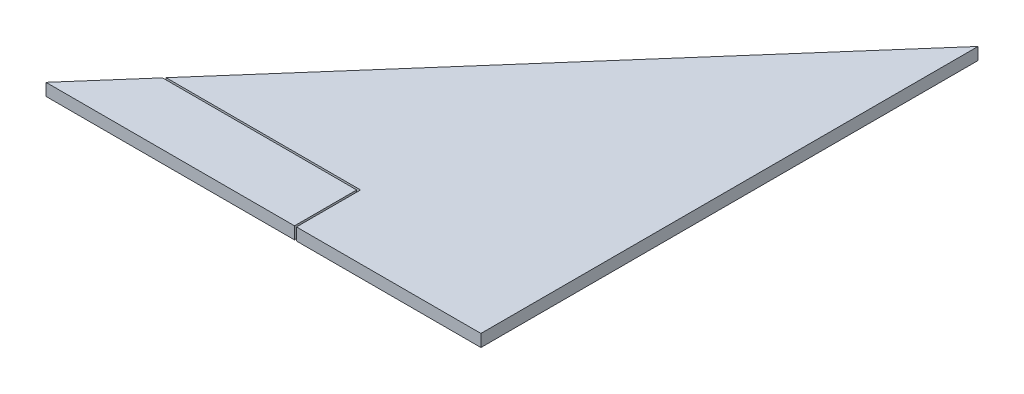
ISO-10303-21;
HEADER;
FILE_DESCRIPTION(('STEP AP214'),'2;1');
FILE_NAME('part.step','',(''),(''),'','','');
FILE_SCHEMA(('AUTOMOTIVE_DESIGN { 1 0 10303 214 1 1 1 1 }'));
ENDSEC;
DATA;
#1=APPLICATION_CONTEXT('core data for automotive mechanical design processes');
#2=APPLICATION_PROTOCOL_DEFINITION('international standard','automotive_design',2000,#1);
#3=PRODUCT_CONTEXT('',#1,'mechanical');
#4=PRODUCT('Part','Part','',(#3));
#5=PRODUCT_RELATED_PRODUCT_CATEGORY('part','',(#4));
#6=PRODUCT_DEFINITION_FORMATION('','',#4);
#7=PRODUCT_DEFINITION_CONTEXT('part definition',#1,'design');
#8=PRODUCT_DEFINITION('design','',#6,#7);
#9=PRODUCT_DEFINITION_SHAPE('','',#8);
#10=(LENGTH_UNIT() NAMED_UNIT(*) SI_UNIT(.MILLI.,.METRE.));
#11=(NAMED_UNIT(*) PLANE_ANGLE_UNIT() SI_UNIT($,.RADIAN.));
#12=(NAMED_UNIT(*) SI_UNIT($,.STERADIAN.) SOLID_ANGLE_UNIT());
#13=UNCERTAINTY_MEASURE_WITH_UNIT(LENGTH_MEASURE(1.E-05),#10,'distance_accuracy_value','');
#14=(GEOMETRIC_REPRESENTATION_CONTEXT(3) GLOBAL_UNCERTAINTY_ASSIGNED_CONTEXT((#13)) GLOBAL_UNIT_ASSIGNED_CONTEXT((#10,
#11,#12)) REPRESENTATION_CONTEXT('',''));
#15=CARTESIAN_POINT('',(0.,0.,0.));
#16=DIRECTION('',(0.,0.,1.));
#17=DIRECTION('',(1.,0.,0.));
#18=AXIS2_PLACEMENT_3D('',#15,#16,#17);
#19=CARTESIAN_POINT('',(-100.700884955752,5.,-88.1132743362832));
#20=DIRECTION('',(0.752576694706878,0.,0.658504607868518));
#21=DIRECTION('',(0.658504607868518,0.,-0.752576694706878));
#22=AXIS2_PLACEMENT_3D('',#19,#20,#21);
#23=PLANE('',#22);
#24=DIRECTION('',(0.,-1.,0.));
#25=VECTOR('',#24,1.);
#26=CARTESIAN_POINT('',(-154.88046875,5.,-26.19375));
#27=LINE('',#26,#25);
#28=CARTESIAN_POINT('',(-154.88046875,5.,-26.19375));
#29=VERTEX_POINT('',#28);
#30=CARTESIAN_POINT('',(-154.88046875,0.,-26.19375));
#31=VERTEX_POINT('',#30);
#32=EDGE_CURVE('E12',#29,#31,#27,.T.);
#33=ORIENTED_EDGE('',*,*,#32,.F.);
#34=DIRECTION('',(-0.658504607868518,0.,0.752576694706878));
#35=VECTOR('',#34,1.);
#36=CARTESIAN_POINT('',(-100.700884955752,5.,-88.1132743362832));
#37=LINE('',#36,#35);
#38=CARTESIAN_POINT('',(0.,5.,-203.2));
#39=VERTEX_POINT('',#38);
#40=EDGE_CURVE('E108',#39,#29,#37,.T.);
#41=ORIENTED_EDGE('',*,*,#40,.F.);
#42=DIRECTION('',(0.,-1.,0.));
#43=VECTOR('',#42,1.);
#44=CARTESIAN_POINT('',(0.,5.,-203.2));
#45=LINE('',#44,#43);
#46=CARTESIAN_POINT('',(0.,0.,-203.2));
#47=VERTEX_POINT('',#46);
#48=EDGE_CURVE('E152',#39,#47,#45,.T.);
#49=ORIENTED_EDGE('',*,*,#48,.T.);
#50=DIRECTION('',(-0.658504607868518,0.,0.752576694706878));
#51=VECTOR('',#50,1.);
#52=CARTESIAN_POINT('',(-100.700884955752,0.,-88.1132743362832));
#53=LINE('',#52,#51);
#54=EDGE_CURVE('E54',#47,#31,#53,.T.);
#55=ORIENTED_EDGE('',*,*,#54,.T.);
#56=EDGE_LOOP('',(#33,#41,#49,#55));
#57=FACE_BOUND('',#56,.T.);
#58=ADVANCED_FACE('F51',(#57),#23,.F.);
#59=CARTESIAN_POINT('',(0.,5.,0.));
#60=DIRECTION('',(0.,0.,-1.));
#61=DIRECTION('',(-1.,0.,0.));
#62=AXIS2_PLACEMENT_3D('',#59,#60,#61);
#63=PLANE('',#62);
#64=DIRECTION('',(0.,-1.,0.));
#65=VECTOR('',#64,1.);
#66=CARTESIAN_POINT('',(-75.40625,6.,0.));
#67=LINE('',#66,#65);
#68=CARTESIAN_POINT('',(-75.40625,5.,0.));
#69=VERTEX_POINT('',#68);
#70=CARTESIAN_POINT('',(-75.40625,0.,0.));
#71=VERTEX_POINT('',#70);
#72=EDGE_CURVE('E91',#69,#71,#67,.T.);
#73=ORIENTED_EDGE('',*,*,#72,.T.);
#74=DIRECTION('',(1.,0.,0.));
#75=VECTOR('',#74,1.);
#76=CARTESIAN_POINT('',(0.,0.,0.));
#77=LINE('',#76,#75);
#78=CARTESIAN_POINT('',(0.,0.,0.));
#79=VERTEX_POINT('',#78);
#80=EDGE_CURVE('E112',#71,#79,#77,.T.);
#81=ORIENTED_EDGE('',*,*,#80,.T.);
#82=DIRECTION('',(0.,-1.,0.));
#83=VECTOR('',#82,1.);
#84=CARTESIAN_POINT('',(0.,5.,0.));
#85=LINE('',#84,#83);
#86=CARTESIAN_POINT('',(0.,5.,0.));
#87=VERTEX_POINT('',#86);
#88=EDGE_CURVE('E102',#87,#79,#85,.T.);
#89=ORIENTED_EDGE('',*,*,#88,.F.);
#90=DIRECTION('',(1.,0.,0.));
#91=VECTOR('',#90,1.);
#92=CARTESIAN_POINT('',(0.,5.,0.));
#93=LINE('',#92,#91);
#94=EDGE_CURVE('E96',#69,#87,#93,.T.);
#95=ORIENTED_EDGE('',*,*,#94,.F.);
#96=EDGE_LOOP('',(#73,#81,#89,#95));
#97=FACE_BOUND('',#96,.T.);
#98=ADVANCED_FACE('F133',(#97),#63,.F.);
#99=CARTESIAN_POINT('',(0.,5.,0.));
#100=DIRECTION('',(0.,1.,0.));
#101=DIRECTION('',(0.,0.,1.));
#102=AXIS2_PLACEMENT_3D('',#99,#100,#101);
#103=PLANE('',#102);
#104=ORIENTED_EDGE('',*,*,#40,.T.);
#105=DIRECTION('',(1.,0.,0.));
#106=VECTOR('',#105,1.);
#107=CARTESIAN_POINT('',(0.,5.,-26.19375));
#108=LINE('',#107,#106);
#109=CARTESIAN_POINT('',(-75.40625,5.,-26.19375));
#110=VERTEX_POINT('',#109);
#111=EDGE_CURVE('E69',#29,#110,#108,.T.);
#112=ORIENTED_EDGE('',*,*,#111,.T.);
#113=DIRECTION('',(0.,0.,1.));
#114=VECTOR('',#113,1.);
#115=CARTESIAN_POINT('',(-75.40625,5.,0.));
#116=LINE('',#115,#114);
#117=EDGE_CURVE('E86',#110,#69,#116,.T.);
#118=ORIENTED_EDGE('',*,*,#117,.T.);
#119=ORIENTED_EDGE('',*,*,#94,.T.);
#120=DIRECTION('',(0.,0.,-1.));
#121=VECTOR('',#120,1.);
#122=CARTESIAN_POINT('',(0.,5.,0.));
#123=LINE('',#122,#121);
#124=EDGE_CURVE('E124',#87,#39,#123,.T.);
#125=ORIENTED_EDGE('',*,*,#124,.T.);
#126=EDGE_LOOP('',(#104,#112,#118,#119,#125));
#127=FACE_BOUND('',#126,.T.);
#128=ADVANCED_FACE('F105',(#127),#103,.T.);
#129=CARTESIAN_POINT('',(0.,0.,0.));
#130=DIRECTION('',(0.,1.,0.));
#131=DIRECTION('',(0.,0.,1.));
#132=AXIS2_PLACEMENT_3D('',#129,#130,#131);
#133=PLANE('',#132);
#134=DIRECTION('',(-1.,0.,0.));
#135=VECTOR('',#134,1.);
#136=CARTESIAN_POINT('',(-76.2,0.,-26.19375));
#137=LINE('',#136,#135);
#138=CARTESIAN_POINT('',(-75.40625,0.,-26.19375));
#139=VERTEX_POINT('',#138);
#140=EDGE_CURVE('E100',#139,#31,#137,.T.);
#141=ORIENTED_EDGE('',*,*,#140,.T.);
#142=ORIENTED_EDGE('',*,*,#54,.F.);
#143=DIRECTION('',(0.,0.,-1.));
#144=VECTOR('',#143,1.);
#145=CARTESIAN_POINT('',(0.,0.,0.));
#146=LINE('',#145,#144);
#147=EDGE_CURVE('E121',#79,#47,#146,.T.);
#148=ORIENTED_EDGE('',*,*,#147,.F.);
#149=ORIENTED_EDGE('',*,*,#80,.F.);
#150=DIRECTION('',(0.,0.,-1.));
#151=VECTOR('',#150,1.);
#152=CARTESIAN_POINT('',(-75.40625,0.,0.));
#153=LINE('',#152,#151);
#154=EDGE_CURVE('E118',#71,#139,#153,.T.);
#155=ORIENTED_EDGE('',*,*,#154,.T.);
#156=EDGE_LOOP('',(#141,#142,#148,#149,#155));
#157=FACE_BOUND('',#156,.T.);
#158=ADVANCED_FACE('F147',(#157),#133,.F.);
#159=CARTESIAN_POINT('',(0.,5.,0.));
#160=DIRECTION('',(-1.,0.,0.));
#161=DIRECTION('',(0.,0.,1.));
#162=AXIS2_PLACEMENT_3D('',#159,#160,#161);
#163=PLANE('',#162);
#164=ORIENTED_EDGE('',*,*,#147,.T.);
#165=ORIENTED_EDGE('',*,*,#48,.F.);
#166=ORIENTED_EDGE('',*,*,#124,.F.);
#167=ORIENTED_EDGE('',*,*,#88,.T.);
#168=EDGE_LOOP('',(#164,#165,#166,#167));
#169=FACE_BOUND('',#168,.T.);
#170=ADVANCED_FACE('F140',(#169),#163,.F.);
#171=CARTESIAN_POINT('',(-75.40625,6.,0.));
#172=DIRECTION('',(-1.,0.,0.));
#173=DIRECTION('',(0.,0.,1.));
#174=AXIS2_PLACEMENT_3D('',#171,#172,#173);
#175=PLANE('',#174);
#176=DIRECTION('',(0.,-1.,0.));
#177=VECTOR('',#176,1.);
#178=CARTESIAN_POINT('',(-75.40625,6.,-26.19375));
#179=LINE('',#178,#177);
#180=EDGE_CURVE('E61',#110,#139,#179,.T.);
#181=ORIENTED_EDGE('',*,*,#180,.T.);
#182=ORIENTED_EDGE('',*,*,#154,.F.);
#183=ORIENTED_EDGE('',*,*,#72,.F.);
#184=ORIENTED_EDGE('',*,*,#117,.F.);
#185=EDGE_LOOP('',(#181,#182,#183,#184));
#186=FACE_BOUND('',#185,.T.);
#187=ADVANCED_FACE('F87',(#186),#175,.T.);
#188=CARTESIAN_POINT('',(-76.2,6.,-26.19375));
#189=DIRECTION('',(0.,0.,1.));
#190=DIRECTION('',(1.,0.,0.));
#191=AXIS2_PLACEMENT_3D('',#188,#189,#190);
#192=PLANE('',#191);
#193=ORIENTED_EDGE('',*,*,#32,.T.);
#194=ORIENTED_EDGE('',*,*,#140,.F.);
#195=ORIENTED_EDGE('',*,*,#180,.F.);
#196=ORIENTED_EDGE('',*,*,#111,.F.);
#197=EDGE_LOOP('',(#193,#194,#195,#196));
#198=FACE_BOUND('',#197,.T.);
#199=ADVANCED_FACE('F98',(#198),#192,.T.);
#200=CLOSED_SHELL('',(#58,#98,#128,#158,#170,#187,#199));
#201=MANIFOLD_SOLID_BREP('B2',#200);
#202=CARTESIAN_POINT('',(0.,5.,0.));
#203=DIRECTION('',(0.,1.,0.));
#204=DIRECTION('',(0.,0.,1.));
#205=AXIS2_PLACEMENT_3D('',#202,#203,#204);
#206=PLANE('',#205);
#207=DIRECTION('',(1.,0.,0.));
#208=VECTOR('',#207,1.);
#209=CARTESIAN_POINT('',(0.,5.,-25.4));
#210=LINE('',#209,#208);
#211=CARTESIAN_POINT('',(-155.575,5.,-25.4));
#212=VERTEX_POINT('',#211);
#213=CARTESIAN_POINT('',(-76.2,5.,-25.4));
#214=VERTEX_POINT('',#213);
#215=EDGE_CURVE('E284',#212,#214,#210,.T.);
#216=ORIENTED_EDGE('',*,*,#215,.F.);
#217=DIRECTION('',(-0.658504607868518,0.,0.752576694706878));
#218=VECTOR('',#217,1.);
#219=CARTESIAN_POINT('',(-100.700884955752,5.,-88.1132743362832));
#220=LINE('',#219,#218);
#221=CARTESIAN_POINT('',(-177.8,5.,0.));
#222=VERTEX_POINT('',#221);
#223=EDGE_CURVE('E246',#212,#222,#220,.T.);
#224=ORIENTED_EDGE('',*,*,#223,.T.);
#225=DIRECTION('',(1.,0.,0.));
#226=VECTOR('',#225,1.);
#227=CARTESIAN_POINT('',(0.,5.,0.));
#228=LINE('',#227,#226);
#229=CARTESIAN_POINT('',(-76.2,5.,0.));
#230=VERTEX_POINT('',#229);
#231=EDGE_CURVE('E230',#222,#230,#228,.T.);
#232=ORIENTED_EDGE('',*,*,#231,.T.);
#233=DIRECTION('',(0.,0.,1.));
#234=VECTOR('',#233,1.);
#235=CARTESIAN_POINT('',(-76.2,5.,0.));
#236=LINE('',#235,#234);
#237=EDGE_CURVE('E279',#214,#230,#236,.T.);
#238=ORIENTED_EDGE('',*,*,#237,.F.);
#239=EDGE_LOOP('',(#216,#224,#232,#238));
#240=FACE_BOUND('',#239,.T.);
#241=ADVANCED_FACE('F222',(#240),#206,.T.);
#242=CARTESIAN_POINT('',(0.,0.,0.));
#243=DIRECTION('',(0.,1.,0.));
#244=DIRECTION('',(0.,0.,1.));
#245=AXIS2_PLACEMENT_3D('',#242,#243,#244);
#246=PLANE('',#245);
#247=DIRECTION('',(-0.658504607868518,0.,0.752576694706878));
#248=VECTOR('',#247,1.);
#249=CARTESIAN_POINT('',(-100.700884955752,0.,-88.1132743362832));
#250=LINE('',#249,#248);
#251=CARTESIAN_POINT('',(-155.575,0.,-25.4));
#252=VERTEX_POINT('',#251);
#253=CARTESIAN_POINT('',(-177.8,0.,0.));
#254=VERTEX_POINT('',#253);
#255=EDGE_CURVE('E277',#252,#254,#250,.T.);
#256=ORIENTED_EDGE('',*,*,#255,.F.);
#257=DIRECTION('',(-1.,0.,0.));
#258=VECTOR('',#257,1.);
#259=CARTESIAN_POINT('',(-76.2,0.,-25.4));
#260=LINE('',#259,#258);
#261=CARTESIAN_POINT('',(-76.2,0.,-25.4));
#262=VERTEX_POINT('',#261);
#263=EDGE_CURVE('E265',#262,#252,#260,.T.);
#264=ORIENTED_EDGE('',*,*,#263,.F.);
#265=DIRECTION('',(0.,0.,-1.));
#266=VECTOR('',#265,1.);
#267=CARTESIAN_POINT('',(-76.2,0.,0.));
#268=LINE('',#267,#266);
#269=CARTESIAN_POINT('',(-76.2,0.,0.));
#270=VERTEX_POINT('',#269);
#271=EDGE_CURVE('E273',#270,#262,#268,.T.);
#272=ORIENTED_EDGE('',*,*,#271,.F.);
#273=DIRECTION('',(1.,0.,0.));
#274=VECTOR('',#273,1.);
#275=CARTESIAN_POINT('',(0.,0.,0.));
#276=LINE('',#275,#274);
#277=EDGE_CURVE('E283',#254,#270,#276,.T.);
#278=ORIENTED_EDGE('',*,*,#277,.F.);
#279=EDGE_LOOP('',(#256,#264,#272,#278));
#280=FACE_BOUND('',#279,.T.);
#281=ADVANCED_FACE('F281',(#280),#246,.F.);
#282=CARTESIAN_POINT('',(0.,5.,0.));
#283=DIRECTION('',(0.,0.,-1.));
#284=DIRECTION('',(-1.,0.,0.));
#285=AXIS2_PLACEMENT_3D('',#282,#283,#284);
#286=PLANE('',#285);
#287=ORIENTED_EDGE('',*,*,#277,.T.);
#288=DIRECTION('',(0.,-1.,0.));
#289=VECTOR('',#288,1.);
#290=CARTESIAN_POINT('',(-76.2,6.,0.));
#291=LINE('',#290,#289);
#292=EDGE_CURVE('E237',#230,#270,#291,.T.);
#293=ORIENTED_EDGE('',*,*,#292,.F.);
#294=ORIENTED_EDGE('',*,*,#231,.F.);
#295=DIRECTION('',(0.,-1.,0.));
#296=VECTOR('',#295,1.);
#297=CARTESIAN_POINT('',(-177.8,5.,0.));
#298=LINE('',#297,#296);
#299=EDGE_CURVE('E49',#222,#254,#298,.T.);
#300=ORIENTED_EDGE('',*,*,#299,.T.);
#301=EDGE_LOOP('',(#287,#293,#294,#300));
#302=FACE_BOUND('',#301,.T.);
#303=ADVANCED_FACE('F296',(#302),#286,.F.);
#304=CARTESIAN_POINT('',(-100.700884955752,5.,-88.1132743362832));
#305=DIRECTION('',(0.752576694706878,0.,0.658504607868518));
#306=DIRECTION('',(0.658504607868518,0.,-0.752576694706878));
#307=AXIS2_PLACEMENT_3D('',#304,#305,#306);
#308=PLANE('',#307);
#309=ORIENTED_EDGE('',*,*,#223,.F.);
#310=DIRECTION('',(0.,-1.,0.));
#311=VECTOR('',#310,1.);
#312=CARTESIAN_POINT('',(-155.575,6.,-25.4));
#313=LINE('',#312,#311);
#314=EDGE_CURVE('E268',#212,#252,#313,.T.);
#315=ORIENTED_EDGE('',*,*,#314,.T.);
#316=ORIENTED_EDGE('',*,*,#255,.T.);
#317=ORIENTED_EDGE('',*,*,#299,.F.);
#318=EDGE_LOOP('',(#309,#315,#316,#317));
#319=FACE_BOUND('',#318,.T.);
#320=ADVANCED_FACE('F224',(#319),#308,.F.);
#321=CARTESIAN_POINT('',(-76.2,6.,-25.4));
#322=DIRECTION('',(0.,0.,1.));
#323=DIRECTION('',(1.,0.,0.));
#324=AXIS2_PLACEMENT_3D('',#321,#322,#323);
#325=PLANE('',#324);
#326=ORIENTED_EDGE('',*,*,#215,.T.);
#327=DIRECTION('',(0.,-1.,0.));
#328=VECTOR('',#327,1.);
#329=CARTESIAN_POINT('',(-76.2,6.,-25.4));
#330=LINE('',#329,#328);
#331=EDGE_CURVE('E270',#214,#262,#330,.T.);
#332=ORIENTED_EDGE('',*,*,#331,.T.);
#333=ORIENTED_EDGE('',*,*,#263,.T.);
#334=ORIENTED_EDGE('',*,*,#314,.F.);
#335=EDGE_LOOP('',(#326,#332,#333,#334));
#336=FACE_BOUND('',#335,.T.);
#337=ADVANCED_FACE('F267',(#336),#325,.F.);
#338=CARTESIAN_POINT('',(-76.2,6.,0.));
#339=DIRECTION('',(-1.,0.,0.));
#340=DIRECTION('',(0.,0.,1.));
#341=AXIS2_PLACEMENT_3D('',#338,#339,#340);
#342=PLANE('',#341);
#343=ORIENTED_EDGE('',*,*,#237,.T.);
#344=ORIENTED_EDGE('',*,*,#292,.T.);
#345=ORIENTED_EDGE('',*,*,#271,.T.);
#346=ORIENTED_EDGE('',*,*,#331,.F.);
#347=EDGE_LOOP('',(#343,#344,#345,#346));
#348=FACE_BOUND('',#347,.T.);
#349=ADVANCED_FACE('F293',(#348),#342,.F.);
#350=CLOSED_SHELL('',(#241,#281,#303,#320,#337,#349));
#351=MANIFOLD_SOLID_BREP('B6',#350);
#352=ADVANCED_BREP_SHAPE_REPRESENTATION('',(#18,#201,#351),#14);
#353=SHAPE_DEFINITION_REPRESENTATION(#9,#352);
ENDSEC;
END-ISO-10303-21;
